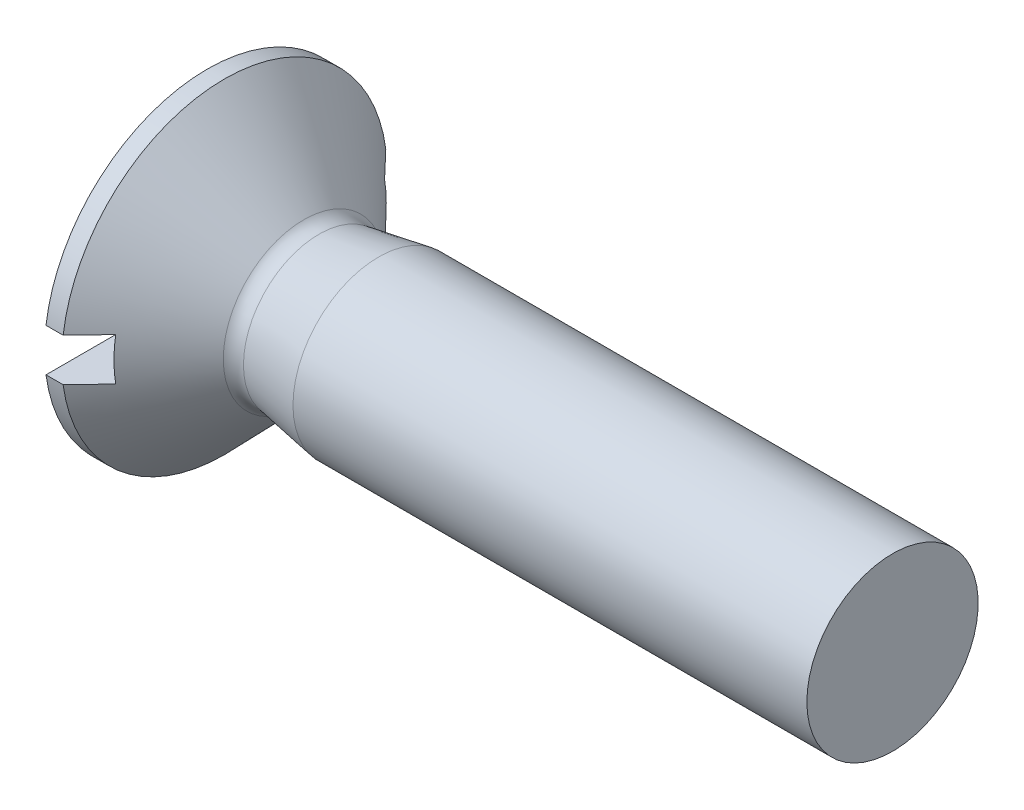
ISO-10303-21;
HEADER;
FILE_DESCRIPTION(('STEP AP214'),'2;1');
FILE_NAME('part.step','',(''),(''),'','','');
FILE_SCHEMA(('AUTOMOTIVE_DESIGN { 1 0 10303 214 1 1 1 1 }'));
ENDSEC;
DATA;
#1=APPLICATION_CONTEXT('core data for automotive mechanical design processes');
#2=APPLICATION_PROTOCOL_DEFINITION('international standard','automotive_design',2000,#1);
#3=PRODUCT_CONTEXT('',#1,'mechanical');
#4=PRODUCT('Part','Part','',(#3));
#5=PRODUCT_RELATED_PRODUCT_CATEGORY('part','',(#4));
#6=PRODUCT_DEFINITION_FORMATION('','',#4);
#7=PRODUCT_DEFINITION_CONTEXT('part definition',#1,'design');
#8=PRODUCT_DEFINITION('design','',#6,#7);
#9=PRODUCT_DEFINITION_SHAPE('','',#8);
#10=(LENGTH_UNIT() NAMED_UNIT(*) SI_UNIT(.MILLI.,.METRE.));
#11=(NAMED_UNIT(*) PLANE_ANGLE_UNIT() SI_UNIT($,.RADIAN.));
#12=(NAMED_UNIT(*) SI_UNIT($,.STERADIAN.) SOLID_ANGLE_UNIT());
#13=UNCERTAINTY_MEASURE_WITH_UNIT(LENGTH_MEASURE(1.E-05),#10,'distance_accuracy_value','');
#14=(GEOMETRIC_REPRESENTATION_CONTEXT(3) GLOBAL_UNCERTAINTY_ASSIGNED_CONTEXT((#13)) GLOBAL_UNIT_ASSIGNED_CONTEXT((#10,
#11,#12)) REPRESENTATION_CONTEXT('',''));
#15=CARTESIAN_POINT('',(0.,0.,0.));
#16=DIRECTION('',(0.,0.,1.));
#17=DIRECTION('',(1.,0.,0.));
#18=AXIS2_PLACEMENT_3D('',#15,#16,#17);
#19=CARTESIAN_POINT('',(0.,0.,0.));
#20=DIRECTION('',(-1.,0.,0.));
#21=DIRECTION('',(0.,0.,1.));
#22=AXIS2_PLACEMENT_3D('',#19,#20,#21);
#23=CYLINDRICAL_SURFACE('',#22,1.9);
#24=CARTESIAN_POINT('',(0.2,0.,0.));
#25=DIRECTION('',(-1.,0.,0.));
#26=DIRECTION('',(0.,0.,1.));
#27=AXIS2_PLACEMENT_3D('',#24,#25,#26);
#28=CIRCLE('',#27,1.9);
#29=CARTESIAN_POINT('',(0.2,-0.249999999999999,-1.88348082018374));
#30=VERTEX_POINT('',#29);
#31=CARTESIAN_POINT('',(0.2,-0.249999999999999,1.88348082018374));
#32=VERTEX_POINT('',#31);
#33=EDGE_CURVE('E109',#30,#32,#28,.T.);
#34=ORIENTED_EDGE('',*,*,#33,.T.);
#35=DIRECTION('',(-1.,0.,0.));
#36=VECTOR('',#35,1.);
#37=CARTESIAN_POINT('',(0.,-0.249999999999999,1.88348082018374));
#38=LINE('',#37,#36);
#39=CARTESIAN_POINT('',(0.,-0.249999999999999,1.88348082018374));
#40=VERTEX_POINT('',#39);
#41=EDGE_CURVE('E110',#32,#40,#38,.T.);
#42=ORIENTED_EDGE('',*,*,#41,.T.);
#43=CARTESIAN_POINT('',(0.,0.,0.));
#44=DIRECTION('',(-1.,0.,0.));
#45=DIRECTION('',(0.,0.,1.));
#46=AXIS2_PLACEMENT_3D('',#43,#44,#45);
#47=CIRCLE('',#46,1.9);
#48=CARTESIAN_POINT('',(0.,-0.249999999999999,-1.88348082018374));
#49=VERTEX_POINT('',#48);
#50=EDGE_CURVE('E171',#49,#40,#47,.T.);
#51=ORIENTED_EDGE('',*,*,#50,.F.);
#52=DIRECTION('',(-1.,0.,0.));
#53=VECTOR('',#52,1.);
#54=CARTESIAN_POINT('',(0.,-0.249999999999999,-1.88348082018374));
#55=LINE('',#54,#53);
#56=EDGE_CURVE('E54',#49,#30,#55,.F.);
#57=ORIENTED_EDGE('',*,*,#56,.T.);
#58=EDGE_LOOP('',(#34,#42,#51,#57));
#59=FACE_BOUND('',#58,.T.);
#60=ADVANCED_FACE('F39',(#59),#23,.T.);
#61=CARTESIAN_POINT('',(0.,0.,0.));
#62=DIRECTION('',(1.,0.,0.));
#63=DIRECTION('',(0.,0.,-1.));
#64=AXIS2_PLACEMENT_3D('',#61,#62,#63);
#65=PLANE('',#64);
#66=CARTESIAN_POINT('',(0.,0.25,1.88348082018374));
#67=VERTEX_POINT('',#66);
#68=CARTESIAN_POINT('',(0.,0.25,-1.88348082018374));
#69=VERTEX_POINT('',#68);
#70=EDGE_CURVE('E167',#67,#69,#47,.T.);
#71=ORIENTED_EDGE('',*,*,#70,.T.);
#72=DIRECTION('',(0.,0.,1.));
#73=VECTOR('',#72,1.);
#74=CARTESIAN_POINT('',(0.,0.25,0.));
#75=LINE('',#74,#73);
#76=EDGE_CURVE('E185',#69,#67,#75,.T.);
#77=ORIENTED_EDGE('',*,*,#76,.T.);
#78=EDGE_LOOP('',(#71,#77));
#79=FACE_BOUND('',#78,.T.);
#80=ADVANCED_FACE('F152',(#79),#65,.F.);
#81=CARTESIAN_POINT('',(8.,1.,0.));
#82=DIRECTION('',(-1.,0.,0.));
#83=DIRECTION('',(0.,0.,1.));
#84=AXIS2_PLACEMENT_3D('',#81,#82,#83);
#85=PLANE('',#84);
#86=CARTESIAN_POINT('',(8.,0.,0.));
#87=DIRECTION('',(-1.,0.,0.));
#88=DIRECTION('',(0.,0.,1.));
#89=AXIS2_PLACEMENT_3D('',#86,#87,#88);
#90=CIRCLE('',#89,1.);
#91=CARTESIAN_POINT('',(8.,0.,1.));
#92=VERTEX_POINT('',#91);
#93=EDGE_CURVE('E181',#92,#92,#90,.T.);
#94=ORIENTED_EDGE('',*,*,#93,.F.);
#95=EDGE_LOOP('',(#94));
#96=FACE_BOUND('',#95,.T.);
#97=ADVANCED_FACE('F41',(#96),#85,.F.);
#98=CARTESIAN_POINT('',(0.,0.,0.));
#99=DIRECTION('',(-1.,0.,0.));
#100=DIRECTION('',(0.,0.,1.));
#101=AXIS2_PLACEMENT_3D('',#98,#99,#100);
#102=CYLINDRICAL_SURFACE('',#101,1.);
#103=CARTESIAN_POINT('',(2.,0.,0.));
#104=DIRECTION('',(-1.,0.,0.));
#105=DIRECTION('',(0.,0.,1.));
#106=AXIS2_PLACEMENT_3D('',#103,#104,#105);
#107=CIRCLE('',#106,1.);
#108=CARTESIAN_POINT('',(2.,0.,1.));
#109=VERTEX_POINT('',#108);
#110=EDGE_CURVE('E178',#109,#109,#107,.T.);
#111=ORIENTED_EDGE('',*,*,#110,.F.);
#112=EDGE_LOOP('',(#111));
#113=FACE_BOUND('',#112,.T.);
#114=ORIENTED_EDGE('',*,*,#93,.T.);
#115=EDGE_LOOP('',(#114));
#116=FACE_BOUND('',#115,.T.);
#117=ADVANCED_FACE('F190',(#113,#116),#102,.T.);
#118=CARTESIAN_POINT('',(2.,0.,0.));
#119=DIRECTION('',(1.,0.,0.));
#120=DIRECTION('',(0.,0.,-1.));
#121=AXIS2_PLACEMENT_3D('',#118,#119,#120);
#122=CONICAL_SURFACE('',#121,1.,0.167819484919047);
#123=CARTESIAN_POINT('',(1.30400038848807,0.,0.));
#124=DIRECTION('',(-1.,0.,0.));
#125=DIRECTION('',(0.,0.,1.));
#126=AXIS2_PLACEMENT_3D('',#123,#124,#125);
#127=CIRCLE('',#126,0.882088692817089);
#128=CARTESIAN_POINT('',(1.30400038848807,0.,0.882088692817089));
#129=VERTEX_POINT('',#128);
#130=EDGE_CURVE('E175',#129,#129,#127,.T.);
#131=ORIENTED_EDGE('',*,*,#130,.F.);
#132=EDGE_LOOP('',(#131));
#133=FACE_BOUND('',#132,.T.);
#134=ORIENTED_EDGE('',*,*,#110,.T.);
#135=EDGE_LOOP('',(#134));
#136=FACE_BOUND('',#135,.T.);
#137=ADVANCED_FACE('F196',(#133,#136),#122,.T.);
#138=CARTESIAN_POINT('',(1.27059381526381,0.,0.));
#139=DIRECTION('',(-1.,0.,0.));
#140=DIRECTION('',(0.,0.,1.));
#141=AXIS2_PLACEMENT_3D('',#138,#139,#140);
#142=TOROIDAL_SURFACE('',#141,1.07927895846277,0.2);
#143=CARTESIAN_POINT('',(1.12672585519608,0.,0.));
#144=DIRECTION('',(-1.,0.,0.));
#145=DIRECTION('',(0.,0.,1.));
#146=AXIS2_PLACEMENT_3D('',#143,#144,#145);
#147=CIRCLE('',#146,0.940347284370966);
#148=CARTESIAN_POINT('',(1.12672585519608,0.,0.940347284370966));
#149=VERTEX_POINT('',#148);
#150=EDGE_CURVE('E169',#149,#149,#147,.T.);
#151=ORIENTED_EDGE('',*,*,#150,.F.);
#152=EDGE_LOOP('',(#151));
#153=FACE_BOUND('',#152,.T.);
#154=ORIENTED_EDGE('',*,*,#130,.T.);
#155=EDGE_LOOP('',(#154));
#156=FACE_BOUND('',#155,.T.);
#157=ADVANCED_FACE('F157',(#153,#156),#142,.F.);
#158=CARTESIAN_POINT('',(1.12672585519608,0.,0.));
#159=DIRECTION('',(-1.,0.,0.));
#160=DIRECTION('',(0.,0.,1.));
#161=AXIS2_PLACEMENT_3D('',#158,#159,#160);
#162=CONICAL_SURFACE('',#161,0.940347284370966,0.802851455917393);
#163=CARTESIAN_POINT('',(0.5,0.,0.));
#164=DIRECTION('',(1.,0.,0.));
#165=DIRECTION('',(0.,1.,0.));
#166=AXIS2_PLACEMENT_3D('',#163,#164,#165);
#167=CIRCLE('',#166,1.58934090586283);
#168=CARTESIAN_POINT('',(0.499999999999999,-0.249999999999999,-1.56955551512168));
#169=VERTEX_POINT('',#168);
#170=CARTESIAN_POINT('',(0.5,0.25,-1.56955551512168));
#171=VERTEX_POINT('',#170);
#172=EDGE_CURVE('E11',#169,#171,#167,.T.);
#173=ORIENTED_EDGE('',*,*,#172,.T.);
#174=CARTESIAN_POINT('',(-2.01601493470514,0.25,4.18729422630551));
#175=CARTESIAN_POINT('',(-1.87664923813912,0.25,4.04271769435418));
#176=CARTESIAN_POINT('',(-1.73729482345771,0.25,3.89813027800257));
#177=CARTESIAN_POINT('',(-1.45862095611518,0.25,3.6089169222469));
#178=CARTESIAN_POINT('',(-1.31930150410232,0.25,3.46429098221823));
#179=CARTESIAN_POINT('',(-1.04066177400944,0.25,3.17493377785335));
#180=CARTESIAN_POINT('',(-0.901341515801131,0.25,3.03020249438092));
#181=CARTESIAN_POINT('',(-0.622782490908927,0.25,2.74066622374668));
#182=CARTESIAN_POINT('',(-0.483543722883639,0.25,2.59586123787586));
#183=CARTESIAN_POINT('',(-0.201786956770368,0.25,2.30257938996187));
#184=CARTESIAN_POINT('',(-0.0592721606083867,0.25,2.15409945232285));
#185=CARTESIAN_POINT('',(0.225528245293348,0.25,1.85690533383418));
#186=CARTESIAN_POINT('',(0.367813843219135,0.25,1.70819114164504));
#187=CARTESIAN_POINT('',(0.580840870368113,0.25,1.48477213973957));
#188=CARTESIAN_POINT('',(0.651774267846905,0.25,1.41025039178459));
#189=CARTESIAN_POINT('',(0.793437145184127,0.25,1.26100995422566));
#190=CARTESIAN_POINT('',(0.864166620773327,0.25,1.18629126056032));
#191=CARTESIAN_POINT('',(1.00526448587424,0.25,1.03652726934552));
#192=CARTESIAN_POINT('',(1.0756329084935,0.25,0.961482002951812));
#193=CARTESIAN_POINT('',(1.21571782760126,0.25,0.810786132033253));
#194=CARTESIAN_POINT('',(1.28543435354055,0.25,0.735135555143891));
#195=CARTESIAN_POINT('',(1.37201750361893,0.25,0.639224449765212));
#196=CARTESIAN_POINT('',(1.3896160368168,0.25,0.619626583408543));
#197=CARTESIAN_POINT('',(1.4246691063127,0.25,0.580302510321601));
#198=CARTESIAN_POINT('',(1.44212364034506,0.25,0.560576301580701));
#199=CARTESIAN_POINT('',(1.49415371529718,0.25,0.501229712885388));
#200=CARTESIAN_POINT('',(1.52846095809073,0.25,0.461369657393176));
#201=CARTESIAN_POINT('',(1.58507933062902,0.25,0.393169607703334));
#202=CARTESIAN_POINT('',(1.6077717062677,0.25,0.365146567609488));
#203=CARTESIAN_POINT('',(1.65204449781809,0.25,0.308059026538506));
#204=CARTESIAN_POINT('',(1.67362100490673,0.25,0.278991399183496));
#205=CARTESIAN_POINT('',(1.71123114196319,0.25,0.22382616683357));
#206=CARTESIAN_POINT('',(1.7276061907623,0.25,0.197963111679399));
#207=CARTESIAN_POINT('',(1.75686731149356,0.25,0.144317811970711));
#208=CARTESIAN_POINT('',(1.7697727012953,0.25,0.116547322101303));
#209=CARTESIAN_POINT('',(1.78402855567211,0.25,0.0717983577731039));
#210=CARTESIAN_POINT('',(1.78796430954531,0.25,0.0556898048400385));
#211=CARTESIAN_POINT('',(1.79285666778232,0.25,0.0230595466848579));
#212=CARTESIAN_POINT('',(1.79382503824804,0.25,0.00653973572952782));
#213=CARTESIAN_POINT('',(1.79256779412007,0.25,-0.0263838004625423));
#214=CARTESIAN_POINT('',(1.79033915987774,0.25,-0.0427874012241021));
#215=CARTESIAN_POINT('',(1.78320931283225,0.25,-0.0750341288284093));
#216=CARTESIAN_POINT('',(1.77829704417356,0.25,-0.0908746463961853));
#217=CARTESIAN_POINT('',(1.76508659022058,0.25,-0.125837594435742));
#218=CARTESIAN_POINT('',(1.75624048953288,0.25,-0.144744602097832));
#219=CARTESIAN_POINT('',(1.73676775330008,0.25,-0.181635353658967));
#220=CARTESIAN_POINT('',(1.7261367353416,0.25,-0.199616679221351));
#221=CARTESIAN_POINT('',(1.70370123401058,0.25,-0.235033462765642));
#222=CARTESIAN_POINT('',(1.69188762334596,0.25,-0.252463049377781));
#223=CARTESIAN_POINT('',(1.66757081663527,0.25,-0.286795734849196));
#224=CARTESIAN_POINT('',(1.65506848487411,0.25,-0.303699453722596));
#225=CARTESIAN_POINT('',(1.61333324317185,0.25,-0.358538111769461));
#226=CARTESIAN_POINT('',(1.58314156582687,0.25,-0.395737930365852));
#227=CARTESIAN_POINT('',(1.5216698640317,0.25,-0.469231644734777));
#228=CARTESIAN_POINT('',(1.49038935658736,0.25,-0.505525125882915));
#229=CARTESIAN_POINT('',(1.42717306094644,0.25,-0.577627630223686));
#230=CARTESIAN_POINT('',(1.39523641414764,0.25,-0.613435901438079));
#231=CARTESIAN_POINT('',(1.33100167337737,0.25,-0.684711577002231));
#232=CARTESIAN_POINT('',(1.29870365403241,0.25,-0.720179049017128));
#233=CARTESIAN_POINT('',(1.20187883299638,0.25,-0.825799529881122));
#234=CARTESIAN_POINT('',(1.13700638296127,0.25,-0.895635369316581));
#235=CARTESIAN_POINT('',(1.00686288225263,0.25,-1.03483505375393));
#236=CARTESIAN_POINT('',(0.941592163859256,0.25,-1.10419921112329));
#237=CARTESIAN_POINT('',(0.757331369017412,0.25,-1.29930120353699));
#238=CARTESIAN_POINT('',(0.638050216922742,0.25,-1.4247640699768));
#239=CARTESIAN_POINT('',(0.399132142423295,0.25,-1.67535206962172));
#240=CARTESIAN_POINT('',(0.279495216130276,0.25,-1.800477199107));
#241=CARTESIAN_POINT('',(0.039982480864666,0.25,-2.05058314132827));
#242=CARTESIAN_POINT('',(-0.0798933973540164,0.25,-2.17556388778698));
#243=CARTESIAN_POINT('',(-0.319760521210998,0.25,-2.42541358736704));
#244=CARTESIAN_POINT('',(-0.439751766391554,0.25,-2.5502825409282));
#245=CARTESIAN_POINT('',(-0.802330817180014,0.25,-2.92738586690317));
#246=CARTESIAN_POINT('',(-1.04502811394854,0.25,-3.1795149529747));
#247=CARTESIAN_POINT('',(-1.53048563082897,0.25,-3.68353034814328));
#248=CARTESIAN_POINT('',(-1.77324579322125,0.25,-3.93541671282475));
#249=CARTESIAN_POINT('',(-2.01601493470514,0.25,-4.18729422630551));
#250=B_SPLINE_CURVE_WITH_KNOTS('',3,(#174,#175,#176,#177,#178,#179,#180,#181,#182,#183,#184,
#185,#186,#187,#188,#189,#190,#191,#192,#193,#194,#195,#196,#197,#198,#199,#200,#201,#202,#203,
#204,#205,#206,#207,#208,#209,#210,#211,#212,#213,#214,#215,#216,#217,#218,#219,#220,#221,#222,
#223,#224,#225,#226,#227,#228,#229,#230,#231,#232,#233,#234,#235,#236,#237,#238,#239,#240,#241,
#242,#243,#244,#245,#246,#247,#248,#249),.UNSPECIFIED.,.F.,.F.,(4,2,2,2,2,2,2,2,2,2,2,2,2,2,2,2,
2,2,2,2,2,2,2,2,2,2,2,2,2,2,2,2,2,2,2,2,2,4),(0.,0.602433856000322,1.20487816004374,
1.80755178193664,2.4102151874483,3.02763789002436,3.64509145957526,3.95374218183071,
4.26239931962769,4.57102762963268,4.87964192868944,4.95866046545058,5.0376802431197,
5.19542898182686,5.30359549595027,5.41211829389888,5.50388214281981,5.5951239734863,
5.64465557396231,5.69399051870495,5.74337209219491,5.79295865572406,5.85541669420085,
5.91803038729474,5.98117131376421,6.04423473310871,6.18790584613683,6.33164152340159,
6.47557906854842,6.61948741872571,6.9054352760994,7.19117049681672,7.71051404804738,
8.22986329617977,8.74939529776958,9.26892524644334,10.3188010616788,11.3682831989146),.UNSPECIFIED.);
#251=CARTESIAN_POINT('',(0.2,0.25,-1.88348082018374));
#252=VERTEX_POINT('',#251);
#253=EDGE_CURVE('E130',#171,#252,#250,.T.);
#254=ORIENTED_EDGE('',*,*,#253,.T.);
#255=CARTESIAN_POINT('',(0.2,0.25,1.88348082018374));
#256=VERTEX_POINT('',#255);
#257=EDGE_CURVE('E166',#256,#252,#28,.T.);
#258=ORIENTED_EDGE('',*,*,#257,.F.);
#259=CARTESIAN_POINT('',(0.5,0.25,1.56955551512168));
#260=VERTEX_POINT('',#259);
#261=EDGE_CURVE('E122',#256,#260,#250,.T.);
#262=ORIENTED_EDGE('',*,*,#261,.T.);
#263=CARTESIAN_POINT('',(0.499999999999999,-0.249999999999999,1.56955551512168));
#264=VERTEX_POINT('',#263);
#265=EDGE_CURVE('E43',#260,#264,#167,.T.);
#266=ORIENTED_EDGE('',*,*,#265,.T.);
#267=CARTESIAN_POINT('',(-2.01601493470514,-0.249999999999999,-4.18729422630551));
#268=CARTESIAN_POINT('',(-1.87664923813912,-0.249999999999999,-4.04271769435418));
#269=CARTESIAN_POINT('',(-1.73729482345771,-0.249999999999999,-3.89813027800256));
#270=CARTESIAN_POINT('',(-1.45862095611517,-0.249999999999999,-3.60891692224689));
#271=CARTESIAN_POINT('',(-1.31930150410231,-0.249999999999999,-3.46429098221822));
#272=CARTESIAN_POINT('',(-1.04066177400943,-0.249999999999999,-3.17493377785335));
#273=CARTESIAN_POINT('',(-0.901341515801126,-0.249999999999999,-3.03020249438091));
#274=CARTESIAN_POINT('',(-0.622782490908921,-0.249999999999999,-2.74066622374667));
#275=CARTESIAN_POINT('',(-0.483543722883633,-0.249999999999999,-2.59586123787585));
#276=CARTESIAN_POINT('',(-0.201786956770361,-0.249999999999999,-2.30257938996186));
#277=CARTESIAN_POINT('',(-0.0592721606083805,-0.249999999999999,-2.15409945232285));
#278=CARTESIAN_POINT('',(0.225528245293354,-0.249999999999999,-1.85690533383417));
#279=CARTESIAN_POINT('',(0.36781384321914,-0.249999999999999,-1.70819114164503));
#280=CARTESIAN_POINT('',(0.580840870368117,-0.249999999999999,-1.48477213973956));
#281=CARTESIAN_POINT('',(0.651774267846908,-0.249999999999999,-1.41025039178459));
#282=CARTESIAN_POINT('',(0.79343714518413,-0.249999999999999,-1.26100995422566));
#283=CARTESIAN_POINT('',(0.864166620773329,-0.249999999999999,-1.18629126056031));
#284=CARTESIAN_POINT('',(1.00526448587424,-0.249999999999999,-1.03652726934552));
#285=CARTESIAN_POINT('',(1.0756329084935,-0.249999999999999,-0.96148200295181));
#286=CARTESIAN_POINT('',(1.21571782760126,-0.249999999999999,-0.810786132033252));
#287=CARTESIAN_POINT('',(1.28543435354056,-0.249999999999999,-0.735135555143891));
#288=CARTESIAN_POINT('',(1.37201750361893,-0.249999999999999,-0.639224449765212));
#289=CARTESIAN_POINT('',(1.3896160368168,-0.249999999999999,-0.619626583408544));
#290=CARTESIAN_POINT('',(1.4246691063127,-0.249999999999999,-0.580302510321601));
#291=CARTESIAN_POINT('',(1.44212364034506,-0.249999999999999,-0.560576301580701));
#292=CARTESIAN_POINT('',(1.49415371529718,-0.249999999999999,-0.501229712885388));
#293=CARTESIAN_POINT('',(1.52846095809073,-0.249999999999999,-0.461369657393176));
#294=CARTESIAN_POINT('',(1.58507933062902,-0.249999999999999,-0.393169607703335));
#295=CARTESIAN_POINT('',(1.6077717062677,-0.249999999999999,-0.365146567609488));
#296=CARTESIAN_POINT('',(1.65204449781809,-0.249999999999999,-0.308059026538507));
#297=CARTESIAN_POINT('',(1.67362100490673,-0.249999999999999,-0.278991399183497));
#298=CARTESIAN_POINT('',(1.71123114196319,-0.249999999999999,-0.223826166833571));
#299=CARTESIAN_POINT('',(1.7276061907623,-0.249999999999999,-0.1979631116794));
#300=CARTESIAN_POINT('',(1.75686731149356,-0.249999999999999,-0.144317811970711));
#301=CARTESIAN_POINT('',(1.7697727012953,-0.249999999999999,-0.116547322101302));
#302=CARTESIAN_POINT('',(1.78402855567211,-0.249999999999999,-0.0717983577731018));
#303=CARTESIAN_POINT('',(1.78796430954531,-0.249999999999999,-0.0556898048400362));
#304=CARTESIAN_POINT('',(1.79285666778232,-0.249999999999999,-0.0230595466848554));
#305=CARTESIAN_POINT('',(1.79382503824804,-0.249999999999999,-0.00653973572952537));
#306=CARTESIAN_POINT('',(1.79256779412007,-0.249999999999999,0.0263838004625447));
#307=CARTESIAN_POINT('',(1.79033915987774,-0.249999999999999,0.0427874012241046));
#308=CARTESIAN_POINT('',(1.78320931283225,-0.249999999999999,0.0750341288284119));
#309=CARTESIAN_POINT('',(1.77829704417356,-0.249999999999999,0.0908746463961878));
#310=CARTESIAN_POINT('',(1.76508659022058,-0.249999999999999,0.125837594435745));
#311=CARTESIAN_POINT('',(1.75624048953288,-0.249999999999999,0.144744602097835));
#312=CARTESIAN_POINT('',(1.73676775330008,-0.249999999999999,0.181635353658971));
#313=CARTESIAN_POINT('',(1.7261367353416,-0.249999999999999,0.199616679221356));
#314=CARTESIAN_POINT('',(1.70370123401058,-0.249999999999999,0.235033462765648));
#315=CARTESIAN_POINT('',(1.69188762334596,-0.249999999999999,0.252463049377787));
#316=CARTESIAN_POINT('',(1.66757081663526,-0.249999999999999,0.286795734849203));
#317=CARTESIAN_POINT('',(1.65506848487411,-0.249999999999999,0.303699453722604));
#318=CARTESIAN_POINT('',(1.61333324317184,-0.249999999999999,0.35853811176947));
#319=CARTESIAN_POINT('',(1.58314156582686,-0.249999999999999,0.395737930365863));
#320=CARTESIAN_POINT('',(1.52166986403169,-0.249999999999999,0.46923164473479));
#321=CARTESIAN_POINT('',(1.49038935658735,-0.249999999999999,0.505525125882929));
#322=CARTESIAN_POINT('',(1.42717306094642,-0.249999999999999,0.577627630223703));
#323=CARTESIAN_POINT('',(1.39523641414762,-0.249999999999999,0.613435901438098));
#324=CARTESIAN_POINT('',(1.33100167337735,-0.249999999999999,0.684711577002252));
#325=CARTESIAN_POINT('',(1.29870365403239,-0.249999999999999,0.720179049017151));
#326=CARTESIAN_POINT('',(1.20187883299635,-0.249999999999999,0.825799529881149));
#327=CARTESIAN_POINT('',(1.13700638296124,-0.249999999999999,0.89563536931661));
#328=CARTESIAN_POINT('',(1.0068628822526,-0.249999999999999,1.03483505375397));
#329=CARTESIAN_POINT('',(0.941592163859221,-0.249999999999999,1.10419921112333));
#330=CARTESIAN_POINT('',(0.757331369017376,-0.249999999999999,1.29930120353703));
#331=CARTESIAN_POINT('',(0.638050216922707,-0.249999999999999,1.42476406997683));
#332=CARTESIAN_POINT('',(0.399132142423264,-0.249999999999999,1.67535206962175));
#333=CARTESIAN_POINT('',(0.279495216130247,-0.249999999999999,1.80047719910703));
#334=CARTESIAN_POINT('',(0.03998248086464,-0.249999999999999,2.0505831413283));
#335=CARTESIAN_POINT('',(-0.0798933973540407,-0.249999999999999,2.175563887787));
#336=CARTESIAN_POINT('',(-0.319760521211019,-0.249999999999999,2.42541358736707));
#337=CARTESIAN_POINT('',(-0.439751766391573,-0.249999999999999,2.55028254092822));
#338=CARTESIAN_POINT('',(-0.802330817180028,-0.249999999999999,2.92738586690319));
#339=CARTESIAN_POINT('',(-1.04502811394855,-0.249999999999999,3.17951495297471));
#340=CARTESIAN_POINT('',(-1.53048563082898,-0.249999999999999,3.68353034814329));
#341=CARTESIAN_POINT('',(-1.77324579322125,-0.249999999999999,3.93541671282475));
#342=CARTESIAN_POINT('',(-2.01601493470514,-0.249999999999999,4.18729422630551));
#343=B_SPLINE_CURVE_WITH_KNOTS('',3,(#267,#268,#269,#270,#271,#272,#273,#274,#275,#276,#277,
#278,#279,#280,#281,#282,#283,#284,#285,#286,#287,#288,#289,#290,#291,#292,#293,#294,#295,#296,
#297,#298,#299,#300,#301,#302,#303,#304,#305,#306,#307,#308,#309,#310,#311,#312,#313,#314,#315,
#316,#317,#318,#319,#320,#321,#322,#323,#324,#325,#326,#327,#328,#329,#330,#331,#332,#333,#334,
#335,#336,#337,#338,#339,#340,#341,#342),.UNSPECIFIED.,.F.,.F.,(4,2,2,2,2,2,2,2,2,2,2,2,2,2,2,2,
2,2,2,2,2,2,2,2,2,2,2,2,2,2,2,2,2,2,2,2,2,4),(0.,0.602433856000326,1.20487816004375,
1.80755178193665,2.41021518744831,3.02763789002436,3.64509145957526,3.95374218183072,
4.26239931962769,4.57102762963268,4.87964192868944,4.95866046545058,5.0376802431197,
5.19542898182685,5.30359549595027,5.41211829389888,5.50388214281981,5.5951239734863,
5.64465557396231,5.69399051870495,5.74337209219491,5.79295865572406,5.85541669420086,
5.91803038729475,5.98117131376422,6.04423473310872,6.18790584613684,6.3316415234016,
6.47557906854845,6.61948741872574,6.90543527609944,7.19117049681677,7.71051404804743,
8.22986329617981,8.74939529776961,9.26892524644336,10.3188010616788,11.3682831989146),.UNSPECIFIED.);
#344=EDGE_CURVE('E103',#264,#32,#343,.T.);
#345=ORIENTED_EDGE('',*,*,#344,.T.);
#346=ORIENTED_EDGE('',*,*,#33,.F.);
#347=EDGE_CURVE('E101',#30,#169,#343,.T.);
#348=ORIENTED_EDGE('',*,*,#347,.T.);
#349=EDGE_LOOP('',(#173,#254,#258,#262,#266,#345,#346,#348));
#350=FACE_BOUND('',#349,.T.);
#351=ORIENTED_EDGE('',*,*,#150,.T.);
#352=EDGE_LOOP('',(#351));
#353=FACE_BOUND('',#352,.T.);
#354=ADVANCED_FACE('F106',(#350,#353),#162,.T.);
#355=ORIENTED_EDGE('',*,*,#257,.T.);
#356=DIRECTION('',(-1.,0.,0.));
#357=VECTOR('',#356,1.);
#358=CARTESIAN_POINT('',(0.,0.25,-1.88348082018374));
#359=LINE('',#358,#357);
#360=EDGE_CURVE('E62',#252,#69,#359,.T.);
#361=ORIENTED_EDGE('',*,*,#360,.T.);
#362=ORIENTED_EDGE('',*,*,#70,.F.);
#363=DIRECTION('',(-1.,0.,0.));
#364=VECTOR('',#363,1.);
#365=CARTESIAN_POINT('',(0.,0.25,1.88348082018374));
#366=LINE('',#365,#364);
#367=EDGE_CURVE('E120',#67,#256,#366,.F.);
#368=ORIENTED_EDGE('',*,*,#367,.T.);
#369=EDGE_LOOP('',(#355,#361,#362,#368));
#370=FACE_BOUND('',#369,.T.);
#371=ADVANCED_FACE('F150',(#370),#23,.T.);
#372=ORIENTED_EDGE('',*,*,#50,.T.);
#373=DIRECTION('',(0.,0.,-1.));
#374=VECTOR('',#373,1.);
#375=CARTESIAN_POINT('',(0.,-0.249999999999999,0.));
#376=LINE('',#375,#374);
#377=EDGE_CURVE('E184',#40,#49,#376,.T.);
#378=ORIENTED_EDGE('',*,*,#377,.T.);
#379=EDGE_LOOP('',(#372,#378));
#380=FACE_BOUND('',#379,.T.);
#381=ADVANCED_FACE('F145',(#380),#65,.F.);
#382=CARTESIAN_POINT('',(0.5,0.25,-1.9));
#383=DIRECTION('',(1.,0.,0.));
#384=DIRECTION('',(0.,1.,0.));
#385=AXIS2_PLACEMENT_3D('',#382,#383,#384);
#386=PLANE('',#385);
#387=DIRECTION('',(0.,0.,1.));
#388=VECTOR('',#387,1.);
#389=CARTESIAN_POINT('',(0.5,0.25,-1.9));
#390=LINE('',#389,#388);
#391=EDGE_CURVE('E97',#171,#260,#390,.T.);
#392=ORIENTED_EDGE('',*,*,#391,.F.);
#393=ORIENTED_EDGE('',*,*,#172,.F.);
#394=DIRECTION('',(0.,0.,1.));
#395=VECTOR('',#394,1.);
#396=CARTESIAN_POINT('',(0.499999999999999,-0.249999999999999,-1.9));
#397=LINE('',#396,#395);
#398=EDGE_CURVE('E94',#169,#264,#397,.T.);
#399=ORIENTED_EDGE('',*,*,#398,.T.);
#400=ORIENTED_EDGE('',*,*,#265,.F.);
#401=EDGE_LOOP('',(#392,#393,#399,#400));
#402=FACE_BOUND('',#401,.T.);
#403=ADVANCED_FACE('F93',(#402),#386,.F.);
#404=CARTESIAN_POINT('',(0.,0.25,-1.9));
#405=DIRECTION('',(0.,1.,0.));
#406=DIRECTION('',(0.,0.,1.));
#407=AXIS2_PLACEMENT_3D('',#404,#405,#406);
#408=PLANE('',#407);
#409=ORIENTED_EDGE('',*,*,#391,.T.);
#410=ORIENTED_EDGE('',*,*,#261,.F.);
#411=ORIENTED_EDGE('',*,*,#367,.F.);
#412=ORIENTED_EDGE('',*,*,#76,.F.);
#413=ORIENTED_EDGE('',*,*,#360,.F.);
#414=ORIENTED_EDGE('',*,*,#253,.F.);
#415=EDGE_LOOP('',(#409,#410,#411,#412,#413,#414));
#416=FACE_BOUND('',#415,.T.);
#417=ADVANCED_FACE('F140',(#416),#408,.F.);
#418=CARTESIAN_POINT('',(0.,-0.249999999999999,-1.9));
#419=DIRECTION('',(0.,-1.,0.));
#420=DIRECTION('',(0.,0.,-1.));
#421=AXIS2_PLACEMENT_3D('',#418,#419,#420);
#422=PLANE('',#421);
#423=ORIENTED_EDGE('',*,*,#398,.F.);
#424=ORIENTED_EDGE('',*,*,#347,.F.);
#425=ORIENTED_EDGE('',*,*,#56,.F.);
#426=ORIENTED_EDGE('',*,*,#377,.F.);
#427=ORIENTED_EDGE('',*,*,#41,.F.);
#428=ORIENTED_EDGE('',*,*,#344,.F.);
#429=EDGE_LOOP('',(#423,#424,#425,#426,#427,#428));
#430=FACE_BOUND('',#429,.T.);
#431=ADVANCED_FACE('F100',(#430),#422,.F.);
#432=CLOSED_SHELL('',(#60,#80,#97,#117,#137,#157,#354,#371,#381,#403,#417,#431));
#433=MANIFOLD_SOLID_BREP('B2',#432);
#434=ADVANCED_BREP_SHAPE_REPRESENTATION('',(#18,#433),#14);
#435=SHAPE_DEFINITION_REPRESENTATION(#9,#434);
ENDSEC;
END-ISO-10303-21;
